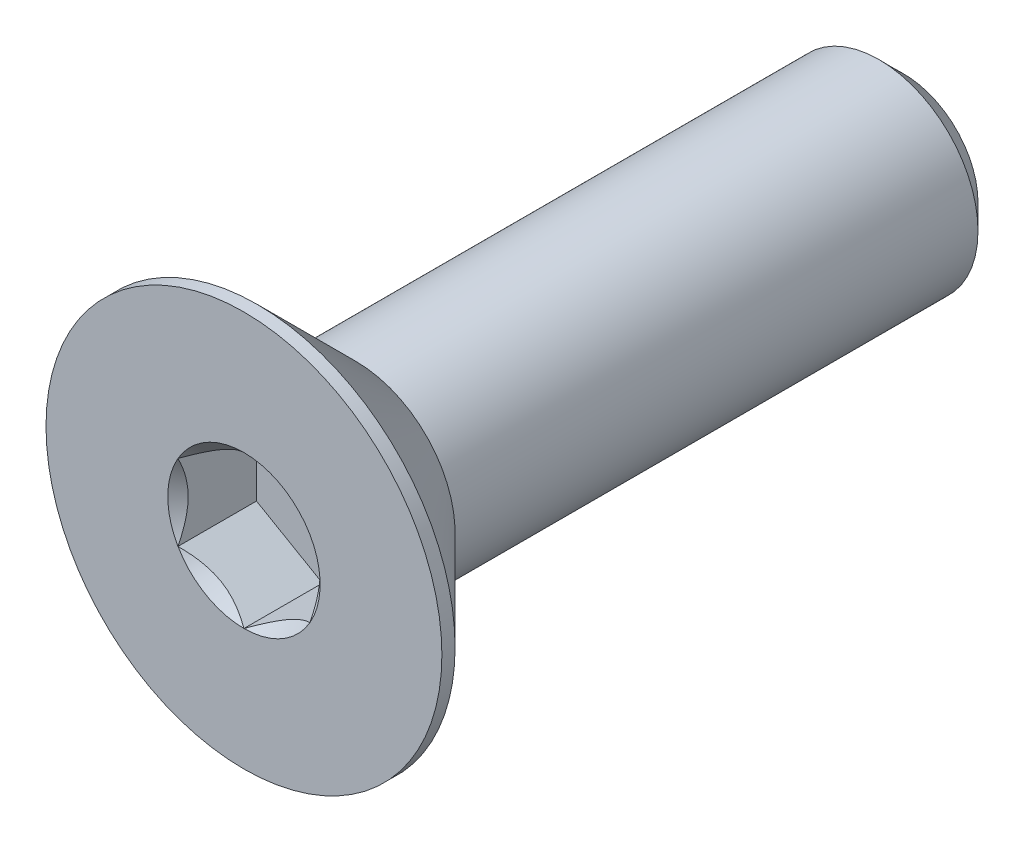
ISO-10303-21;
HEADER;
FILE_DESCRIPTION(('STEP AP214'),'2;1');
FILE_NAME('part.step','',(''),(''),'','','');
FILE_SCHEMA(('AUTOMOTIVE_DESIGN { 1 0 10303 214 1 1 1 1 }'));
ENDSEC;
DATA;
#1=APPLICATION_CONTEXT('core data for automotive mechanical design processes');
#2=APPLICATION_PROTOCOL_DEFINITION('international standard','automotive_design',2000,#1);
#3=PRODUCT_CONTEXT('',#1,'mechanical');
#4=PRODUCT('Part','Part','',(#3));
#5=PRODUCT_RELATED_PRODUCT_CATEGORY('part','',(#4));
#6=PRODUCT_DEFINITION_FORMATION('','',#4);
#7=PRODUCT_DEFINITION_CONTEXT('part definition',#1,'design');
#8=PRODUCT_DEFINITION('design','',#6,#7);
#9=PRODUCT_DEFINITION_SHAPE('','',#8);
#10=(LENGTH_UNIT() NAMED_UNIT(*) SI_UNIT(.MILLI.,.METRE.));
#11=(NAMED_UNIT(*) PLANE_ANGLE_UNIT() SI_UNIT($,.RADIAN.));
#12=(NAMED_UNIT(*) SI_UNIT($,.STERADIAN.) SOLID_ANGLE_UNIT());
#13=UNCERTAINTY_MEASURE_WITH_UNIT(LENGTH_MEASURE(1.E-05),#10,'distance_accuracy_value','');
#14=(GEOMETRIC_REPRESENTATION_CONTEXT(3) GLOBAL_UNCERTAINTY_ASSIGNED_CONTEXT((#13)) GLOBAL_UNIT_ASSIGNED_CONTEXT((#10,
#11,#12)) REPRESENTATION_CONTEXT('',''));
#15=CARTESIAN_POINT('',(0.,0.,0.));
#16=DIRECTION('',(0.,0.,1.));
#17=DIRECTION('',(1.,0.,0.));
#18=AXIS2_PLACEMENT_3D('',#15,#16,#17);
#19=CARTESIAN_POINT('',(1.,-0.577350269189626,-1.19));
#20=DIRECTION('',(0.,0.,1.));
#21=DIRECTION('',(1.,0.,0.));
#22=AXIS2_PLACEMENT_3D('',#19,#20,#21);
#23=PLANE('',#22);
#24=DIRECTION('',(0.,1.,0.));
#25=VECTOR('',#24,1.);
#26=CARTESIAN_POINT('',(-1.,0.577350269189626,-1.19));
#27=LINE('',#26,#25);
#28=CARTESIAN_POINT('',(-0.999999999999999,0.577350269189625,-1.19));
#29=VERTEX_POINT('',#28);
#30=CARTESIAN_POINT('',(-1.,-0.577350269189626,-1.19));
#31=VERTEX_POINT('',#30);
#32=EDGE_CURVE('E83',#29,#31,#27,.F.);
#33=ORIENTED_EDGE('',*,*,#32,.T.);
#34=DIRECTION('',(0.866025403784439,-0.5,0.));
#35=VECTOR('',#34,1.);
#36=CARTESIAN_POINT('',(-1.,-0.577350269189626,-1.19));
#37=LINE('',#36,#35);
#38=CARTESIAN_POINT('',(0.,-1.15470053837925,-1.19));
#39=VERTEX_POINT('',#38);
#40=EDGE_CURVE('E85',#31,#39,#37,.T.);
#41=ORIENTED_EDGE('',*,*,#40,.T.);
#42=DIRECTION('',(0.866025403784439,0.5,0.));
#43=VECTOR('',#42,1.);
#44=CARTESIAN_POINT('',(0.,-1.15470053837925,-1.19));
#45=LINE('',#44,#43);
#46=CARTESIAN_POINT('',(1.,-0.577350269189626,-1.19));
#47=VERTEX_POINT('',#46);
#48=EDGE_CURVE('E86',#39,#47,#45,.T.);
#49=ORIENTED_EDGE('',*,*,#48,.T.);
#50=DIRECTION('',(0.,1.,0.));
#51=VECTOR('',#50,1.);
#52=CARTESIAN_POINT('',(1.,-0.577350269189626,-1.19));
#53=LINE('',#52,#51);
#54=CARTESIAN_POINT('',(1.,0.577350269189626,-1.19));
#55=VERTEX_POINT('',#54);
#56=EDGE_CURVE('E72',#47,#55,#53,.T.);
#57=ORIENTED_EDGE('',*,*,#56,.T.);
#58=DIRECTION('',(-0.866025403784439,0.5,0.));
#59=VECTOR('',#58,1.);
#60=CARTESIAN_POINT('',(1.,0.577350269189626,-1.19));
#61=LINE('',#60,#59);
#62=CARTESIAN_POINT('',(0.,1.15470053837925,-1.19));
#63=VERTEX_POINT('',#62);
#64=EDGE_CURVE('E111',#55,#63,#61,.T.);
#65=ORIENTED_EDGE('',*,*,#64,.T.);
#66=DIRECTION('',(-0.866025403784439,-0.5,0.));
#67=VECTOR('',#66,1.);
#68=CARTESIAN_POINT('',(0.,1.15470053837925,-1.19));
#69=LINE('',#68,#67);
#70=EDGE_CURVE('E116',#63,#29,#69,.T.);
#71=ORIENTED_EDGE('',*,*,#70,.T.);
#72=EDGE_LOOP('',(#33,#41,#49,#57,#65,#71));
#73=FACE_BOUND('',#72,.T.);
#74=ADVANCED_FACE('F17',(#73),#23,.T.);
#75=CARTESIAN_POINT('',(0.,-1.15470053837925,-1.19));
#76=DIRECTION('',(0.5,-0.866025403784439,0.));
#77=DIRECTION('',(0.866025403784439,0.5,0.));
#78=AXIS2_PLACEMENT_3D('',#75,#76,#77);
#79=PLANE('',#78);
#80=CARTESIAN_POINT('',(-3.93149117159769E-11,-1.15470053837926,-9.98108794507433E-11));
#81=CARTESIAN_POINT('',(0.0343705355201057,-1.13485670043636,-0.019824700422141));
#82=CARTESIAN_POINT('',(0.0693156756519455,-1.11468111438035,-0.0384849664872145));
#83=CARTESIAN_POINT('',(0.140572403035621,-1.07354102364821,-0.0726511232407905));
#84=CARTESIAN_POINT('',(0.176890763106012,-1.05257260868342,-0.0881380101422933));
#85=CARTESIAN_POINT('',(0.250125097696328,-1.01029074589262,-0.11466695978462));
#86=CARTESIAN_POINT('',(0.287022429458597,-0.988988061467716,-0.125775687570534));
#87=CARTESIAN_POINT('',(0.361628600499482,-0.945914168534358,-0.142891513233382));
#88=CARTESIAN_POINT('',(0.399335163701569,-0.924144274119301,-0.148911380305544));
#89=CARTESIAN_POINT('',(0.464327716043936,-0.886620806529054,-0.154341115390247));
#90=CARTESIAN_POINT('',(0.491529304810035,-0.87091596193258,-0.155143433217331));
#91=CARTESIAN_POINT('',(0.545879708710831,-0.839536741609904,-0.153791220399352));
#92=CARTESIAN_POINT('',(0.573028510861523,-0.823862373380022,-0.151636036594819));
#93=CARTESIAN_POINT('',(0.654087027893978,-0.777063216751215,-0.140876680449877));
#94=CARTESIAN_POINT('',(0.707593237347495,-0.746171392319914,-0.127977491939688));
#95=CARTESIAN_POINT('',(0.801462739355952,-0.691975810066637,-0.0968623195341796));
#96=CARTESIAN_POINT('',(0.842267871071583,-0.668416956286299,-0.0802830124023648));
#97=CARTESIAN_POINT('',(0.922281198810023,-0.622221239977752,-0.0429387151524039));
#98=CARTESIAN_POINT('',(0.961494106307927,-0.599581657278129,-0.0221873504710733));
#99=CARTESIAN_POINT('',(1.00000000003183,-0.577350269171246,-1.09229319045489E-10));
#100=B_SPLINE_CURVE_WITH_KNOTS('',3,(#80,#81,#82,#83,#84,#85,#86,#87,#88,#89,#90,#91,#92,#93,
#94,#95,#96,#97,#98,#99),.UNSPECIFIED.,.F.,.F.,(4,2,2,2,2,2,2,2,2,4),(0.,0.133182946587487,
0.267141541479663,0.398973326833972,0.530473323727982,0.624596460473079,0.718740387507005,
0.907081600610891,1.05673041335255,1.20589820631879),.UNSPECIFIED.);
#101=CARTESIAN_POINT('',(0.,-1.15470053839843,-1.08428123155448E-10));
#102=VERTEX_POINT('',#101);
#103=CARTESIAN_POINT('',(1.00000000001661,-0.577350269199215,-1.08427884492241E-10));
#104=VERTEX_POINT('',#103);
#105=EDGE_CURVE('E20',#102,#104,#100,.T.);
#106=ORIENTED_EDGE('',*,*,#105,.T.);
#107=DIRECTION('',(0.,0.,-1.));
#108=VECTOR('',#107,1.);
#109=CARTESIAN_POINT('',(1.,-0.577350269189626,-1.19));
#110=LINE('',#109,#108);
#111=EDGE_CURVE('E91',#104,#47,#110,.T.);
#112=ORIENTED_EDGE('',*,*,#111,.T.);
#113=ORIENTED_EDGE('',*,*,#48,.F.);
#114=DIRECTION('',(0.,0.,1.));
#115=VECTOR('',#114,1.);
#116=CARTESIAN_POINT('',(0.,-1.15470053837925,-1.19));
#117=LINE('',#116,#115);
#118=EDGE_CURVE('E59',#39,#102,#117,.T.);
#119=ORIENTED_EDGE('',*,*,#118,.T.);
#120=EDGE_LOOP('',(#106,#112,#113,#119));
#121=FACE_BOUND('',#120,.T.);
#122=ADVANCED_FACE('F90',(#121),#79,.F.);
#123=CARTESIAN_POINT('',(-1.,-0.577350269189626,-1.19));
#124=DIRECTION('',(-0.5,-0.866025403784439,0.));
#125=DIRECTION('',(0.866025403784439,-0.5,0.));
#126=AXIS2_PLACEMENT_3D('',#123,#124,#125);
#127=PLANE('',#126);
#128=CARTESIAN_POINT('',(-1.00000000001966,-0.577350269155583,-9.98096276046598E-11));
#129=CARTESIAN_POINT('',(-0.965629464472823,-0.597194107120269,-0.0198247004221396));
#130=CARTESIAN_POINT('',(-0.930684324346155,-0.617369693185242,-0.0384849664872131));
#131=CARTESIAN_POINT('',(-0.859427596966287,-0.658509783923978,-0.0726511232407891));
#132=CARTESIAN_POINT('',(-0.823109236894494,-0.679478198886334,-0.0881380101422919));
#133=CARTESIAN_POINT('',(-0.749874902303172,-0.721760061675394,-0.114666959784619));
#134=CARTESIAN_POINT('',(-0.71297757054127,-0.743062746100931,-0.125775687570532));
#135=CARTESIAN_POINT('',(-0.638371399500649,-0.786136639034746,-0.14289151323338));
#136=CARTESIAN_POINT('',(-0.600664836298461,-0.807906533449627,-0.148911380305542));
#137=CARTESIAN_POINT('',(-0.535672283956042,-0.845430001039785,-0.154341115390246));
#138=CARTESIAN_POINT('',(-0.508470695189959,-0.861134845636286,-0.155143433217329));
#139=CARTESIAN_POINT('',(-0.454120291289175,-0.892514065958982,-0.15379122039935));
#140=CARTESIAN_POINT('',(-0.426971489138479,-0.908188434188858,-0.151636036594817));
#141=CARTESIAN_POINT('',(-0.345912972106017,-0.954987590817655,-0.140876680449876));
#142=CARTESIAN_POINT('',(-0.292406762652503,-0.985879415248961,-0.127977491939686));
#143=CARTESIAN_POINT('',(-0.198537260644048,-1.04007499750224,-0.0968623195341786));
#144=CARTESIAN_POINT('',(-0.157732128928417,-1.06363385128258,-0.0802830124023638));
#145=CARTESIAN_POINT('',(-0.0777188011899764,-1.10982956759112,-0.0429387151524029));
#146=CARTESIAN_POINT('',(-0.0385058936920724,-1.13246915029075,-0.0221873504710723));
#147=CARTESIAN_POINT('',(3.18328951443562E-11,-1.15470053839763,-1.09228385770901E-10));
#148=B_SPLINE_CURVE_WITH_KNOTS('',3,(#128,#129,#130,#131,#132,#133,#134,#135,#136,#137,#138,
#139,#140,#141,#142,#143,#144,#145,#146,#147),.UNSPECIFIED.,.F.,.F.,(4,2,2,2,2,2,2,2,2,4),(0.,
0.133182946587487,0.267141541479662,0.398973326833972,0.530473323727981,0.624596460473079,
0.718740387507004,0.907081600610891,1.05673041335255,1.20589820631879),.UNSPECIFIED.);
#149=CARTESIAN_POINT('',(-1.00000000001661,-0.577350269199216,-1.0842737551488E-10));
#150=VERTEX_POINT('',#149);
#151=EDGE_CURVE('E95',#150,#102,#148,.T.);
#152=ORIENTED_EDGE('',*,*,#151,.T.);
#153=ORIENTED_EDGE('',*,*,#118,.F.);
#154=ORIENTED_EDGE('',*,*,#40,.F.);
#155=DIRECTION('',(0.,0.,1.));
#156=VECTOR('',#155,1.);
#157=CARTESIAN_POINT('',(-1.,-0.577350269189626,-1.19));
#158=LINE('',#157,#156);
#159=EDGE_CURVE('E97',#31,#150,#158,.T.);
#160=ORIENTED_EDGE('',*,*,#159,.T.);
#161=EDGE_LOOP('',(#152,#153,#154,#160));
#162=FACE_BOUND('',#161,.T.);
#163=ADVANCED_FACE('F93',(#162),#127,.F.);
#164=CARTESIAN_POINT('',(-1.,0.577350269189626,-1.19));
#165=DIRECTION('',(-1.,0.,0.));
#166=DIRECTION('',(0.,0.,1.));
#167=AXIS2_PLACEMENT_3D('',#164,#165,#166);
#168=PLANE('',#167);
#169=CARTESIAN_POINT('',(-0.999999999980349,0.577350269223676,-9.98097329294954E-11));
#170=CARTESIAN_POINT('',(-0.999999999992929,0.537662593316093,-0.0198247004221396));
#171=CARTESIAN_POINT('',(-0.999999999998101,0.497311421195105,-0.0384849664872131));
#172=CARTESIAN_POINT('',(-1.00000000000191,0.41503123972423,-0.0726511232407892));
#173=CARTESIAN_POINT('',(-1.00000000000051,0.373094409797089,-0.0881380101422921));
#174=CARTESIAN_POINT('',(-0.999999999999501,0.288530684217224,-0.114666959784619));
#175=CARTESIAN_POINT('',(-0.999999999999868,0.245925315366786,-0.125775687570532));
#176=CARTESIAN_POINT('',(-1.00000000000013,0.159777529499614,-0.142891513233381));
#177=CARTESIAN_POINT('',(-1.00000000000003,0.116237740669674,-0.148911380305542));
#178=CARTESIAN_POINT('',(-0.999999999999979,0.0411908054892712,-0.154341115390246));
#179=CARTESIAN_POINT('',(-0.999999999999994,0.00978111629629506,-0.155143433217329));
#180=CARTESIAN_POINT('',(-1.00000000000001,-0.0529773243490767,-0.15379122039935));
#181=CARTESIAN_POINT('',(-1.,-0.0843260608088347,-0.151636036594817));
#182=CARTESIAN_POINT('',(-0.999999999999996,-0.177924374066439,-0.140876680449876));
#183=CARTESIAN_POINT('',(-0.999999999999999,-0.239708022929046,-0.127977491939686));
#184=CARTESIAN_POINT('',(-1.,-0.348099187435602,-0.0968623195341786));
#185=CARTESIAN_POINT('',(-1.,-0.395216894996278,-0.0802830124023637));
#186=CARTESIAN_POINT('',(-1.,-0.48760832761337,-0.0429387151524027));
#187=CARTESIAN_POINT('',(-0.999999999999999,-0.532887493012616,-0.0221873504710721));
#188=CARTESIAN_POINT('',(-1.,-0.577350269226384,-1.09228152961273E-10));
#189=B_SPLINE_CURVE_WITH_KNOTS('',3,(#169,#170,#171,#172,#173,#174,#175,#176,#177,#178,#179,
#180,#181,#182,#183,#184,#185,#186,#187,#188),.UNSPECIFIED.,.F.,.F.,(4,2,2,2,2,2,2,2,2,4),(0.,
0.133182946587487,0.267141541479662,0.398973326833972,0.530473323727981,0.624596460473079,
0.718740387507004,0.907081600610891,1.05673041335255,1.20589820631879),.UNSPECIFIED.);
#190=CARTESIAN_POINT('',(-1.00000000001661,0.577350269199215,-1.08428019358982E-10));
#191=VERTEX_POINT('',#190);
#192=EDGE_CURVE('E195',#191,#150,#189,.T.);
#193=ORIENTED_EDGE('',*,*,#192,.T.);
#194=ORIENTED_EDGE('',*,*,#159,.F.);
#195=ORIENTED_EDGE('',*,*,#32,.F.);
#196=DIRECTION('',(0.,0.,1.));
#197=VECTOR('',#196,1.);
#198=CARTESIAN_POINT('',(-0.999999999999999,0.577350269189625,-1.19));
#199=LINE('',#198,#197);
#200=EDGE_CURVE('E113',#29,#191,#199,.T.);
#201=ORIENTED_EDGE('',*,*,#200,.T.);
#202=EDGE_LOOP('',(#193,#194,#195,#201));
#203=FACE_BOUND('',#202,.T.);
#204=ADVANCED_FACE('F205',(#203),#168,.F.);
#205=CARTESIAN_POINT('',(0.,1.15470053837925,-1.19));
#206=DIRECTION('',(-0.5,0.866025403784439,0.));
#207=DIRECTION('',(-0.866025403784439,-0.5,0.));
#208=AXIS2_PLACEMENT_3D('',#205,#206,#207);
#209=PLANE('',#208);
#210=CARTESIAN_POINT('',(3.93151632829924E-11,1.15470053837926,-9.98107715657998E-11));
#211=CARTESIAN_POINT('',(-0.0343705355201053,1.13485670043636,-0.0198247004221408));
#212=CARTESIAN_POINT('',(-0.0693156756519452,1.11468111438035,-0.0384849664872144));
#213=CARTESIAN_POINT('',(-0.140572403035621,1.07354102364821,-0.0726511232407903));
#214=CARTESIAN_POINT('',(-0.176890763106012,1.05257260868342,-0.0881380101422931));
#215=CARTESIAN_POINT('',(-0.250125097696327,1.01029074589262,-0.11466695978462));
#216=CARTESIAN_POINT('',(-0.287022429458596,0.988988061467716,-0.125775687570534));
#217=CARTESIAN_POINT('',(-0.361628600499482,0.945914168534359,-0.142891513233382));
#218=CARTESIAN_POINT('',(-0.399335163701568,0.924144274119301,-0.148911380305543));
#219=CARTESIAN_POINT('',(-0.464327716043936,0.886620806529055,-0.154341115390247));
#220=CARTESIAN_POINT('',(-0.491529304810035,0.87091596193258,-0.155143433217331));
#221=CARTESIAN_POINT('',(-0.54587970871083,0.839536741609904,-0.153791220399352));
#222=CARTESIAN_POINT('',(-0.573028510861522,0.823862373380022,-0.151636036594819));
#223=CARTESIAN_POINT('',(-0.654087027893978,0.777063216751215,-0.140876680449878));
#224=CARTESIAN_POINT('',(-0.707593237347495,0.746171392319914,-0.127977491939688));
#225=CARTESIAN_POINT('',(-0.801462739355952,0.691975810066637,-0.0968623195341798));
#226=CARTESIAN_POINT('',(-0.842267871071583,0.668416956286299,-0.0802830124023649));
#227=CARTESIAN_POINT('',(-0.922281198810023,0.622221239977752,-0.0429387151524038));
#228=CARTESIAN_POINT('',(-0.961494106307926,0.599581657278129,-0.0221873504710732));
#229=CARTESIAN_POINT('',(-1.00000000003183,0.577350269171245,-1.09229129721644E-10));
#230=B_SPLINE_CURVE_WITH_KNOTS('',3,(#210,#211,#212,#213,#214,#215,#216,#217,#218,#219,#220,
#221,#222,#223,#224,#225,#226,#227,#228,#229),.UNSPECIFIED.,.F.,.F.,(4,2,2,2,2,2,2,2,2,4),(0.,
0.133182946587487,0.267141541479662,0.398973326833972,0.530473323727982,0.624596460473079,
0.718740387507005,0.907081600610891,1.05673041335255,1.20589820631879),.UNSPECIFIED.);
#231=CARTESIAN_POINT('',(0.,1.15470053839843,-1.08428125444796E-10));
#232=VERTEX_POINT('',#231);
#233=EDGE_CURVE('E187',#232,#191,#230,.T.);
#234=ORIENTED_EDGE('',*,*,#233,.T.);
#235=ORIENTED_EDGE('',*,*,#200,.F.);
#236=ORIENTED_EDGE('',*,*,#70,.F.);
#237=DIRECTION('',(0.,0.,1.));
#238=VECTOR('',#237,1.);
#239=CARTESIAN_POINT('',(0.,1.15470053837925,-1.19));
#240=LINE('',#239,#238);
#241=EDGE_CURVE('E108',#63,#232,#240,.T.);
#242=ORIENTED_EDGE('',*,*,#241,.T.);
#243=EDGE_LOOP('',(#234,#235,#236,#242));
#244=FACE_BOUND('',#243,.T.);
#245=ADVANCED_FACE('F201',(#244),#209,.F.);
#246=CARTESIAN_POINT('',(1.,0.577350269189626,-1.19));
#247=DIRECTION('',(0.5,0.866025403784439,0.));
#248=DIRECTION('',(-0.866025403784439,0.5,0.));
#249=AXIS2_PLACEMENT_3D('',#246,#247,#248);
#250=PLANE('',#249);
#251=CARTESIAN_POINT('',(1.00000000001966,0.577350269155583,-9.98095486581229E-11));
#252=CARTESIAN_POINT('',(0.965629464472823,0.597194107120269,-0.0198247004221397));
#253=CARTESIAN_POINT('',(0.930684324346155,0.617369693185242,-0.0384849664872132));
#254=CARTESIAN_POINT('',(0.859427596966287,0.658509783923978,-0.0726511232407891));
#255=CARTESIAN_POINT('',(0.823109236894494,0.679478198886334,-0.0881380101422918));
#256=CARTESIAN_POINT('',(0.749874902303172,0.721760061675394,-0.114666959784619));
#257=CARTESIAN_POINT('',(0.712977570541271,0.743062746100931,-0.125775687570532));
#258=CARTESIAN_POINT('',(0.638371399500649,0.786136639034746,-0.142891513233381));
#259=CARTESIAN_POINT('',(0.600664836298461,0.807906533449627,-0.148911380305542));
#260=CARTESIAN_POINT('',(0.535672283956042,0.845430001039784,-0.154341115390246));
#261=CARTESIAN_POINT('',(0.508470695189959,0.861134845636286,-0.155143433217329));
#262=CARTESIAN_POINT('',(0.454120291289175,0.892514065958982,-0.15379122039935));
#263=CARTESIAN_POINT('',(0.426971489138479,0.908188434188858,-0.151636036594817));
#264=CARTESIAN_POINT('',(0.345912972106017,0.954987590817654,-0.140876680449876));
#265=CARTESIAN_POINT('',(0.292406762652503,0.985879415248961,-0.127977491939686));
#266=CARTESIAN_POINT('',(0.198537260644048,1.04007499750224,-0.0968623195341785));
#267=CARTESIAN_POINT('',(0.157732128928417,1.06363385128258,-0.0802830124023638));
#268=CARTESIAN_POINT('',(0.0777188011899766,1.10982956759112,-0.042938715152403));
#269=CARTESIAN_POINT('',(0.0385058936920726,1.13246915029075,-0.0221873504710725));
#270=CARTESIAN_POINT('',(-3.18326351011692E-11,1.15470053839763,-1.0922858632033E-10));
#271=B_SPLINE_CURVE_WITH_KNOTS('',3,(#251,#252,#253,#254,#255,#256,#257,#258,#259,#260,#261,
#262,#263,#264,#265,#266,#267,#268,#269,#270),.UNSPECIFIED.,.F.,.F.,(4,2,2,2,2,2,2,2,2,4),(0.,
0.133182946587487,0.267141541479662,0.398973326833972,0.530473323727981,0.624596460473079,
0.718740387507004,0.907081600610891,1.05673041335255,1.20589820631879),.UNSPECIFIED.);
#272=CARTESIAN_POINT('',(1.00000000001661,0.577350269199216,-1.08427368443792E-10));
#273=VERTEX_POINT('',#272);
#274=EDGE_CURVE('E157',#273,#232,#271,.T.);
#275=ORIENTED_EDGE('',*,*,#274,.T.);
#276=ORIENTED_EDGE('',*,*,#241,.F.);
#277=ORIENTED_EDGE('',*,*,#64,.F.);
#278=DIRECTION('',(0.,0.,-1.));
#279=VECTOR('',#278,1.);
#280=CARTESIAN_POINT('',(1.,0.577350269189626,-1.19));
#281=LINE('',#280,#279);
#282=EDGE_CURVE('E40',#55,#273,#281,.F.);
#283=ORIENTED_EDGE('',*,*,#282,.T.);
#284=EDGE_LOOP('',(#275,#276,#277,#283));
#285=FACE_BOUND('',#284,.T.);
#286=ADVANCED_FACE('F204',(#285),#250,.F.);
#287=CARTESIAN_POINT('',(1.,-0.577350269189626,-1.19));
#288=DIRECTION('',(1.,0.,0.));
#289=DIRECTION('',(0.,0.,-1.));
#290=AXIS2_PLACEMENT_3D('',#287,#288,#289);
#291=PLANE('',#290);
#292=CARTESIAN_POINT('',(0.999999999980349,-0.577350269223676,-9.98095949384892E-11));
#293=CARTESIAN_POINT('',(0.999999999992929,-0.537662593316093,-0.0198247004221395));
#294=CARTESIAN_POINT('',(0.999999999998101,-0.497311421195106,-0.0384849664872131));
#295=CARTESIAN_POINT('',(1.00000000000191,-0.41503123972423,-0.0726511232407892));
#296=CARTESIAN_POINT('',(1.00000000000051,-0.373094409797089,-0.0881380101422921));
#297=CARTESIAN_POINT('',(0.999999999999501,-0.288530684217224,-0.114666959784619));
#298=CARTESIAN_POINT('',(0.999999999999868,-0.245925315366786,-0.125775687570532));
#299=CARTESIAN_POINT('',(1.00000000000013,-0.159777529499614,-0.142891513233381));
#300=CARTESIAN_POINT('',(1.00000000000003,-0.116237740669674,-0.148911380305542));
#301=CARTESIAN_POINT('',(0.999999999999979,-0.0411908054892709,-0.154341115390246));
#302=CARTESIAN_POINT('',(0.999999999999994,-0.00978111629629477,-0.155143433217329));
#303=CARTESIAN_POINT('',(1.00000000000001,0.052977324349077,-0.15379122039935));
#304=CARTESIAN_POINT('',(1.,0.084326060808835,-0.151636036594817));
#305=CARTESIAN_POINT('',(0.999999999999996,0.177924374066439,-0.140876680449876));
#306=CARTESIAN_POINT('',(0.999999999999999,0.239708022929047,-0.127977491939686));
#307=CARTESIAN_POINT('',(1.,0.348099187435603,-0.0968623195341784));
#308=CARTESIAN_POINT('',(1.,0.395216894996278,-0.0802830124023636));
#309=CARTESIAN_POINT('',(1.,0.48760832761337,-0.0429387151524028));
#310=CARTESIAN_POINT('',(0.999999999999999,0.532887493012616,-0.0221873504710722));
#311=CARTESIAN_POINT('',(1.,0.577350269226384,-1.09228152479802E-10));
#312=B_SPLINE_CURVE_WITH_KNOTS('',3,(#292,#293,#294,#295,#296,#297,#298,#299,#300,#301,#302,
#303,#304,#305,#306,#307,#308,#309,#310,#311),.UNSPECIFIED.,.F.,.F.,(4,2,2,2,2,2,2,2,2,4),(0.,
0.133182946587487,0.267141541479663,0.398973326833972,0.530473323727982,0.624596460473079,
0.718740387507005,0.907081600610892,1.05673041335255,1.20589820631879),.UNSPECIFIED.);
#313=EDGE_CURVE('E149',#104,#273,#312,.T.);
#314=ORIENTED_EDGE('',*,*,#313,.T.);
#315=ORIENTED_EDGE('',*,*,#282,.F.);
#316=ORIENTED_EDGE('',*,*,#56,.F.);
#317=ORIENTED_EDGE('',*,*,#111,.F.);
#318=EDGE_LOOP('',(#314,#315,#316,#317));
#319=FACE_BOUND('',#318,.T.);
#320=ADVANCED_FACE('F165',(#319),#291,.F.);
#321=CARTESIAN_POINT('',(0.,0.,-1.70530256582424E-10));
#322=DIRECTION('',(0.,0.,1.));
#323=DIRECTION('',(1.,0.,0.));
#324=AXIS2_PLACEMENT_3D('',#321,#322,#323);
#325=CONICAL_SURFACE('',#324,1.15470053833633,0.785398163397448);
#326=ORIENTED_EDGE('',*,*,#105,.F.);
#327=CARTESIAN_POINT('',(0.,0.,-1.13686837721616E-10));
#328=DIRECTION('',(0.,0.,1.));
#329=DIRECTION('',(1.,0.,0.));
#330=AXIS2_PLACEMENT_3D('',#327,#328,#329);
#331=CIRCLE('',#330,1.15470053839317);
#332=EDGE_CURVE('E146',#104,#102,#331,.F.);
#333=ORIENTED_EDGE('',*,*,#332,.F.);
#334=EDGE_LOOP('',(#326,#333));
#335=FACE_BOUND('',#334,.T.);
#336=ADVANCED_FACE('F222',(#335),#325,.F.);
#337=CARTESIAN_POINT('',(0.,0.,-1.70530256582424E-10));
#338=DIRECTION('',(0.,0.,1.));
#339=DIRECTION('',(1.,0.,0.));
#340=AXIS2_PLACEMENT_3D('',#337,#338,#339);
#341=CONICAL_SURFACE('',#340,1.15470053833633,0.785398163397448);
#342=ORIENTED_EDGE('',*,*,#151,.F.);
#343=CARTESIAN_POINT('',(0.,0.,-1.13686837721616E-10));
#344=DIRECTION('',(0.,0.,1.));
#345=DIRECTION('',(1.,0.,0.));
#346=AXIS2_PLACEMENT_3D('',#343,#344,#345);
#347=CIRCLE('',#346,1.15470053839317);
#348=EDGE_CURVE('E143',#102,#150,#347,.F.);
#349=ORIENTED_EDGE('',*,*,#348,.F.);
#350=EDGE_LOOP('',(#342,#349));
#351=FACE_BOUND('',#350,.T.);
#352=ADVANCED_FACE('F219',(#351),#341,.F.);
#353=CARTESIAN_POINT('',(0.,0.,-1.70530256582424E-10));
#354=DIRECTION('',(0.,0.,1.));
#355=DIRECTION('',(1.,0.,0.));
#356=AXIS2_PLACEMENT_3D('',#353,#354,#355);
#357=CONICAL_SURFACE('',#356,1.15470053833633,0.785398163397448);
#358=ORIENTED_EDGE('',*,*,#192,.F.);
#359=CARTESIAN_POINT('',(0.,0.,-1.13686837721616E-10));
#360=DIRECTION('',(0.,0.,1.));
#361=DIRECTION('',(1.,0.,0.));
#362=AXIS2_PLACEMENT_3D('',#359,#360,#361);
#363=CIRCLE('',#362,1.15470053839317);
#364=EDGE_CURVE('E140',#150,#191,#363,.F.);
#365=ORIENTED_EDGE('',*,*,#364,.F.);
#366=EDGE_LOOP('',(#358,#365));
#367=FACE_BOUND('',#366,.T.);
#368=ADVANCED_FACE('F183',(#367),#357,.F.);
#369=CARTESIAN_POINT('',(0.,0.,-1.70530256582424E-10));
#370=DIRECTION('',(0.,0.,1.));
#371=DIRECTION('',(1.,0.,0.));
#372=AXIS2_PLACEMENT_3D('',#369,#370,#371);
#373=CONICAL_SURFACE('',#372,1.15470053833633,0.785398163397448);
#374=ORIENTED_EDGE('',*,*,#233,.F.);
#375=CARTESIAN_POINT('',(0.,0.,-1.13686837721616E-10));
#376=DIRECTION('',(0.,0.,1.));
#377=DIRECTION('',(1.,0.,0.));
#378=AXIS2_PLACEMENT_3D('',#375,#376,#377);
#379=CIRCLE('',#378,1.15470053839317);
#380=EDGE_CURVE('E137',#191,#232,#379,.F.);
#381=ORIENTED_EDGE('',*,*,#380,.F.);
#382=EDGE_LOOP('',(#374,#381));
#383=FACE_BOUND('',#382,.T.);
#384=ADVANCED_FACE('F178',(#383),#373,.F.);
#385=CARTESIAN_POINT('',(0.,0.,-1.70530256582424E-10));
#386=DIRECTION('',(0.,0.,1.));
#387=DIRECTION('',(1.,0.,0.));
#388=AXIS2_PLACEMENT_3D('',#385,#386,#387);
#389=CONICAL_SURFACE('',#388,1.15470053833633,0.785398163397448);
#390=ORIENTED_EDGE('',*,*,#274,.F.);
#391=CARTESIAN_POINT('',(0.,0.,-1.13686837721616E-10));
#392=DIRECTION('',(0.,0.,1.));
#393=DIRECTION('',(1.,0.,0.));
#394=AXIS2_PLACEMENT_3D('',#391,#392,#393);
#395=CIRCLE('',#394,1.15470053839317);
#396=EDGE_CURVE('E134',#232,#273,#395,.F.);
#397=ORIENTED_EDGE('',*,*,#396,.F.);
#398=EDGE_LOOP('',(#390,#397));
#399=FACE_BOUND('',#398,.T.);
#400=ADVANCED_FACE('F172',(#399),#389,.F.);
#401=CARTESIAN_POINT('',(0.,0.,-1.70530256582424E-10));
#402=DIRECTION('',(0.,0.,1.));
#403=DIRECTION('',(1.,0.,0.));
#404=AXIS2_PLACEMENT_3D('',#401,#402,#403);
#405=CONICAL_SURFACE('',#404,1.15470053833633,0.785398163397448);
#406=CARTESIAN_POINT('',(0.,0.,-1.13686837721616E-10));
#407=DIRECTION('',(0.,0.,1.));
#408=DIRECTION('',(1.,0.,0.));
#409=AXIS2_PLACEMENT_3D('',#406,#407,#408);
#410=CIRCLE('',#409,1.15470053839317);
#411=EDGE_CURVE('E131',#273,#104,#410,.F.);
#412=ORIENTED_EDGE('',*,*,#411,.F.);
#413=ORIENTED_EDGE('',*,*,#313,.F.);
#414=EDGE_LOOP('',(#412,#413));
#415=FACE_BOUND('',#414,.T.);
#416=ADVANCED_FACE('F167',(#415),#405,.F.);
#417=CARTESIAN_POINT('',(0.,-1.5,0.));
#418=DIRECTION('',(0.,0.,1.));
#419=DIRECTION('',(0.,-1.,0.));
#420=AXIS2_PLACEMENT_3D('',#417,#418,#419);
#421=PLANE('',#420);
#422=ORIENTED_EDGE('',*,*,#396,.T.);
#423=ORIENTED_EDGE('',*,*,#411,.T.);
#424=ORIENTED_EDGE('',*,*,#332,.T.);
#425=ORIENTED_EDGE('',*,*,#348,.T.);
#426=ORIENTED_EDGE('',*,*,#364,.T.);
#427=ORIENTED_EDGE('',*,*,#380,.T.);
#428=EDGE_LOOP('',(#422,#423,#424,#425,#426,#427));
#429=FACE_BOUND('',#428,.T.);
#430=CARTESIAN_POINT('',(0.,0.,0.));
#431=DIRECTION('',(0.,0.,1.));
#432=DIRECTION('',(0.,-1.,0.));
#433=AXIS2_PLACEMENT_3D('',#430,#431,#432);
#434=CIRCLE('',#433,3.);
#435=CARTESIAN_POINT('',(0.,-3.,0.));
#436=VERTEX_POINT('',#435);
#437=EDGE_CURVE('E128',#436,#436,#434,.F.);
#438=ORIENTED_EDGE('',*,*,#437,.F.);
#439=EDGE_LOOP('',(#438));
#440=FACE_BOUND('',#439,.T.);
#441=ADVANCED_FACE('F171',(#429,#440),#421,.T.);
#442=CARTESIAN_POINT('',(0.,-1.5,-10.));
#443=DIRECTION('',(0.,0.,-1.));
#444=DIRECTION('',(0.,1.,0.));
#445=AXIS2_PLACEMENT_3D('',#442,#443,#444);
#446=PLANE('',#445);
#447=CARTESIAN_POINT('',(0.,0.,-10.0000000000477));
#448=DIRECTION('',(0.,0.,1.));
#449=DIRECTION('',(1.,0.,0.));
#450=AXIS2_PLACEMENT_3D('',#447,#448,#449);
#451=CIRCLE('',#450,1.12499999988813);
#452=CARTESIAN_POINT('',(1.12499999988813,0.,-10.0000000000477));
#453=VERTEX_POINT('',#452);
#454=EDGE_CURVE('E124',#453,#453,#451,.T.);
#455=ORIENTED_EDGE('',*,*,#454,.F.);
#456=EDGE_LOOP('',(#455));
#457=FACE_BOUND('',#456,.T.);
#458=ADVANCED_FACE('F250',(#457),#446,.T.);
#459=CARTESIAN_POINT('',(0.,0.,0.));
#460=DIRECTION('',(0.,0.,1.));
#461=DIRECTION('',(0.,-1.,0.));
#462=AXIS2_PLACEMENT_3D('',#459,#460,#461);
#463=CYLINDRICAL_SURFACE('',#462,3.);
#464=CARTESIAN_POINT('',(0.,0.,-0.200000000006641));
#465=DIRECTION('',(0.,0.,1.));
#466=DIRECTION('',(0.,-1.,0.));
#467=AXIS2_PLACEMENT_3D('',#464,#465,#466);
#468=CIRCLE('',#467,3.00000000004275);
#469=CARTESIAN_POINT('',(0.,-3.00000000004275,-0.200000000006639));
#470=VERTEX_POINT('',#469);
#471=EDGE_CURVE('E127',#470,#470,#468,.F.);
#472=ORIENTED_EDGE('',*,*,#471,.F.);
#473=EDGE_LOOP('',(#472));
#474=FACE_BOUND('',#473,.T.);
#475=ORIENTED_EDGE('',*,*,#437,.T.);
#476=EDGE_LOOP('',(#475));
#477=FACE_BOUND('',#476,.T.);
#478=ADVANCED_FACE('F247',(#474,#477),#463,.T.);
#479=CARTESIAN_POINT('',(0.,0.,-9.62499999997135));
#480=DIRECTION('',(0.,0.,1.));
#481=DIRECTION('',(1.,0.,0.));
#482=AXIS2_PLACEMENT_3D('',#479,#480,#481);
#483=CONICAL_SURFACE('',#482,1.50000000002137,0.78539816347324);
#484=ORIENTED_EDGE('',*,*,#454,.T.);
#485=EDGE_LOOP('',(#484));
#486=FACE_BOUND('',#485,.T.);
#487=CARTESIAN_POINT('',(0.,0.,-9.62499999999999));
#488=DIRECTION('',(0.,0.,-1.));
#489=DIRECTION('',(0.,1.,0.));
#490=AXIS2_PLACEMENT_3D('',#487,#488,#489);
#491=CIRCLE('',#490,1.5);
#492=CARTESIAN_POINT('',(0.,1.5,-9.62499999999999));
#493=VERTEX_POINT('',#492);
#494=EDGE_CURVE('E31',#493,#493,#491,.F.);
#495=ORIENTED_EDGE('',*,*,#494,.F.);
#496=EDGE_LOOP('',(#495));
#497=FACE_BOUND('',#496,.T.);
#498=ADVANCED_FACE('F240',(#486,#497),#483,.T.);
#499=CARTESIAN_POINT('',(0.,0.,-0.200000000177172));
#500=DIRECTION('',(0.,0.,1.));
#501=DIRECTION('',(0.,-1.,0.));
#502=AXIS2_PLACEMENT_3D('',#499,#500,#501);
#503=CONICAL_SURFACE('',#502,2.99999999987222,0.785398163397449);
#504=CARTESIAN_POINT('',(0.,0.,-1.7));
#505=DIRECTION('',(0.,0.,-1.));
#506=DIRECTION('',(0.,1.,0.));
#507=AXIS2_PLACEMENT_3D('',#504,#505,#506);
#508=CIRCLE('',#507,1.5);
#509=CARTESIAN_POINT('',(0.,1.5,-1.7));
#510=VERTEX_POINT('',#509);
#511=EDGE_CURVE('E11',#510,#510,#508,.T.);
#512=ORIENTED_EDGE('',*,*,#511,.F.);
#513=EDGE_LOOP('',(#512));
#514=FACE_BOUND('',#513,.T.);
#515=ORIENTED_EDGE('',*,*,#471,.T.);
#516=EDGE_LOOP('',(#515));
#517=FACE_BOUND('',#516,.T.);
#518=ADVANCED_FACE('F234',(#514,#517),#503,.T.);
#519=CARTESIAN_POINT('',(0.,0.,-10.));
#520=DIRECTION('',(0.,0.,-1.));
#521=DIRECTION('',(0.,1.,0.));
#522=AXIS2_PLACEMENT_3D('',#519,#520,#521);
#523=CYLINDRICAL_SURFACE('',#522,1.5);
#524=ORIENTED_EDGE('',*,*,#511,.T.);
#525=EDGE_LOOP('',(#524));
#526=FACE_BOUND('',#525,.T.);
#527=ORIENTED_EDGE('',*,*,#494,.T.);
#528=EDGE_LOOP('',(#527));
#529=FACE_BOUND('',#528,.T.);
#530=ADVANCED_FACE('F232',(#526,#529),#523,.T.);
#531=CLOSED_SHELL('',(#74,#122,#163,#204,#245,#286,#320,#336,#352,#368,#384,#400,#416,#441,#458,
#478,#498,#518,#530));
#532=MANIFOLD_SOLID_BREP('B1',#531);
#533=ADVANCED_BREP_SHAPE_REPRESENTATION('',(#18,#532),#14);
#534=SHAPE_DEFINITION_REPRESENTATION(#9,#533);
ENDSEC;
END-ISO-10303-21;
